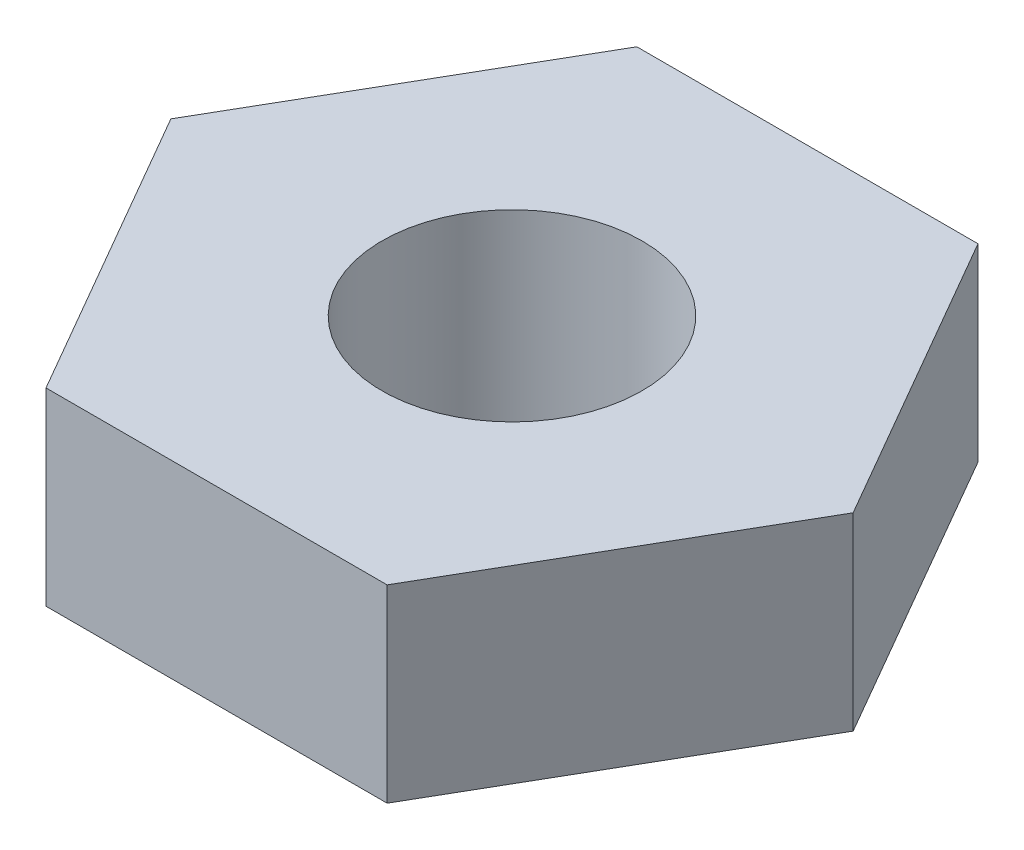
ISO-10303-21;
HEADER;
FILE_DESCRIPTION(('STEP AP214'),'2;1');
FILE_NAME('part.step','',(''),(''),'','','');
FILE_SCHEMA(('AUTOMOTIVE_DESIGN { 1 0 10303 214 1 1 1 1 }'));
ENDSEC;
DATA;
#1=APPLICATION_CONTEXT('core data for automotive mechanical design processes');
#2=APPLICATION_PROTOCOL_DEFINITION('international standard','automotive_design',2000,#1);
#3=PRODUCT_CONTEXT('',#1,'mechanical');
#4=PRODUCT('Part','Part','',(#3));
#5=PRODUCT_RELATED_PRODUCT_CATEGORY('part','',(#4));
#6=PRODUCT_DEFINITION_FORMATION('','',#4);
#7=PRODUCT_DEFINITION_CONTEXT('part definition',#1,'design');
#8=PRODUCT_DEFINITION('design','',#6,#7);
#9=PRODUCT_DEFINITION_SHAPE('','',#8);
#10=(LENGTH_UNIT() NAMED_UNIT(*) SI_UNIT(.MILLI.,.METRE.));
#11=(NAMED_UNIT(*) PLANE_ANGLE_UNIT() SI_UNIT($,.RADIAN.));
#12=(NAMED_UNIT(*) SI_UNIT($,.STERADIAN.) SOLID_ANGLE_UNIT());
#13=UNCERTAINTY_MEASURE_WITH_UNIT(LENGTH_MEASURE(1.E-05),#10,'distance_accuracy_value','');
#14=(GEOMETRIC_REPRESENTATION_CONTEXT(3) GLOBAL_UNCERTAINTY_ASSIGNED_CONTEXT((#13)) GLOBAL_UNIT_ASSIGNED_CONTEXT((#10,
#11,#12)) REPRESENTATION_CONTEXT('',''));
#15=CARTESIAN_POINT('',(0.,0.,0.));
#16=DIRECTION('',(0.,0.,1.));
#17=DIRECTION('',(1.,0.,0.));
#18=AXIS2_PLACEMENT_3D('',#15,#16,#17);
#19=CARTESIAN_POINT('',(0.721687933526279,0.799999999999999,-1.25000016807691));
#20=DIRECTION('',(0.,0.,0.999999999999997));
#21=DIRECTION('',(0.999999999999997,0.,0.));
#22=AXIS2_PLACEMENT_3D('',#19,#20,#21);
#23=PLANE('',#22);
#24=DIRECTION('',(-0.999999999999997,0.,0.));
#25=VECTOR('',#24,1.);
#26=CARTESIAN_POINT('',(0.721687933526279,0.,-1.25000016807691));
#27=LINE('',#26,#25);
#28=CARTESIAN_POINT('',(0.721687933526279,0.,-1.25000016807691));
#29=VERTEX_POINT('',#28);
#30=CARTESIAN_POINT('',(-0.721687933526278,0.,-1.25000016807691));
#31=VERTEX_POINT('',#30);
#32=EDGE_CURVE('E116',#29,#31,#27,.T.);
#33=ORIENTED_EDGE('',*,*,#32,.T.);
#34=DIRECTION('',(0.,-1.,0.));
#35=VECTOR('',#34,1.);
#36=CARTESIAN_POINT('',(-0.721687933526278,0.799999999999999,-1.25000016807691));
#37=LINE('',#36,#35);
#38=CARTESIAN_POINT('',(-0.721687933526278,0.799999999999999,-1.25000016807691));
#39=VERTEX_POINT('',#38);
#40=EDGE_CURVE('E11',#39,#31,#37,.T.);
#41=ORIENTED_EDGE('',*,*,#40,.F.);
#42=DIRECTION('',(-0.999999999999997,0.,0.));
#43=VECTOR('',#42,1.);
#44=CARTESIAN_POINT('',(0.721687933526279,0.799999999999999,-1.25000016807691));
#45=LINE('',#44,#43);
#46=CARTESIAN_POINT('',(0.721687933526279,0.799999999999999,-1.25000016807691));
#47=VERTEX_POINT('',#46);
#48=EDGE_CURVE('E127',#47,#39,#45,.T.);
#49=ORIENTED_EDGE('',*,*,#48,.F.);
#50=DIRECTION('',(0.,-1.,0.));
#51=VECTOR('',#50,1.);
#52=CARTESIAN_POINT('',(0.721687933526279,0.799999999999999,-1.25000016807691));
#53=LINE('',#52,#51);
#54=EDGE_CURVE('E112',#47,#29,#53,.T.);
#55=ORIENTED_EDGE('',*,*,#54,.T.);
#56=EDGE_LOOP('',(#33,#41,#49,#55));
#57=FACE_BOUND('',#56,.T.);
#58=ADVANCED_FACE('F32',(#57),#23,.F.);
#59=CARTESIAN_POINT('',(-0.721687933526278,0.799999999999999,-1.25000016807691));
#60=DIRECTION('',(0.866025403784436,0.,0.499999999999998));
#61=DIRECTION('',(0.499999999999998,0.,-0.866025403784436));
#62=AXIS2_PLACEMENT_3D('',#59,#60,#61);
#63=PLANE('',#62);
#64=DIRECTION('',(-0.499999999999998,0.,0.866025403784437));
#65=VECTOR('',#64,1.);
#66=CARTESIAN_POINT('',(-0.721687933526278,0.,-1.25000016807691));
#67=LINE('',#66,#65);
#68=CARTESIAN_POINT('',(-1.44337586705256,0.,0.));
#69=VERTEX_POINT('',#68);
#70=EDGE_CURVE('E119',#31,#69,#67,.T.);
#71=ORIENTED_EDGE('',*,*,#70,.T.);
#72=DIRECTION('',(0.,-1.,0.));
#73=VECTOR('',#72,1.);
#74=CARTESIAN_POINT('',(-1.44337586705256,0.799999999999999,0.));
#75=LINE('',#74,#73);
#76=CARTESIAN_POINT('',(-1.44337586705256,0.799999999999999,0.));
#77=VERTEX_POINT('',#76);
#78=EDGE_CURVE('E40',#77,#69,#75,.T.);
#79=ORIENTED_EDGE('',*,*,#78,.F.);
#80=DIRECTION('',(-0.499999999999998,0.,0.866025403784437));
#81=VECTOR('',#80,1.);
#82=CARTESIAN_POINT('',(-0.721687933526278,0.799999999999999,-1.25000016807691));
#83=LINE('',#82,#81);
#84=EDGE_CURVE('E85',#39,#77,#83,.T.);
#85=ORIENTED_EDGE('',*,*,#84,.F.);
#86=ORIENTED_EDGE('',*,*,#40,.T.);
#87=EDGE_LOOP('',(#71,#79,#85,#86));
#88=FACE_BOUND('',#87,.T.);
#89=ADVANCED_FACE('F152',(#88),#63,.F.);
#90=CARTESIAN_POINT('',(-1.44337586705256,0.799999999999999,0.));
#91=DIRECTION('',(0.866025403784436,0.,-0.499999999999998));
#92=DIRECTION('',(-0.499999999999999,0.,-0.866025403784436));
#93=AXIS2_PLACEMENT_3D('',#90,#91,#92);
#94=PLANE('',#93);
#95=DIRECTION('',(0.499999999999998,0.,0.866025403784436));
#96=VECTOR('',#95,1.);
#97=CARTESIAN_POINT('',(-1.44337586705256,0.,0.));
#98=LINE('',#97,#96);
#99=CARTESIAN_POINT('',(-0.721687933526277,0.,1.2500001680769));
#100=VERTEX_POINT('',#99);
#101=EDGE_CURVE('E122',#69,#100,#98,.T.);
#102=ORIENTED_EDGE('',*,*,#101,.T.);
#103=DIRECTION('',(0.,-1.,0.));
#104=VECTOR('',#103,1.);
#105=CARTESIAN_POINT('',(-0.721687933526277,0.8,1.2500001680769));
#106=LINE('',#105,#104);
#107=CARTESIAN_POINT('',(-0.721687933526277,0.8,1.2500001680769));
#108=VERTEX_POINT('',#107);
#109=EDGE_CURVE('E107',#108,#100,#106,.T.);
#110=ORIENTED_EDGE('',*,*,#109,.F.);
#111=DIRECTION('',(0.499999999999998,0.,0.866025403784436));
#112=VECTOR('',#111,1.);
#113=CARTESIAN_POINT('',(-1.44337586705256,0.799999999999999,0.));
#114=LINE('',#113,#112);
#115=EDGE_CURVE('E98',#77,#108,#114,.T.);
#116=ORIENTED_EDGE('',*,*,#115,.F.);
#117=ORIENTED_EDGE('',*,*,#78,.T.);
#118=EDGE_LOOP('',(#102,#110,#116,#117));
#119=FACE_BOUND('',#118,.T.);
#120=ADVANCED_FACE('F133',(#119),#94,.F.);
#121=CARTESIAN_POINT('',(-0.721687933526277,0.8,1.2500001680769));
#122=DIRECTION('',(0.,0.,-0.999999999999997));
#123=DIRECTION('',(-0.999999999999997,0.,0.));
#124=AXIS2_PLACEMENT_3D('',#121,#122,#123);
#125=PLANE('',#124);
#126=DIRECTION('',(0.999999999999997,0.,0.));
#127=VECTOR('',#126,1.);
#128=CARTESIAN_POINT('',(-0.721687933526277,0.,1.2500001680769));
#129=LINE('',#128,#127);
#130=CARTESIAN_POINT('',(0.721687933526278,0.,1.25000016807691));
#131=VERTEX_POINT('',#130);
#132=EDGE_CURVE('E106',#100,#131,#129,.T.);
#133=ORIENTED_EDGE('',*,*,#132,.T.);
#134=DIRECTION('',(0.,-1.,0.));
#135=VECTOR('',#134,1.);
#136=CARTESIAN_POINT('',(0.721687933526279,0.8,1.2500001680769));
#137=LINE('',#136,#135);
#138=CARTESIAN_POINT('',(0.721687933526279,0.8,1.2500001680769));
#139=VERTEX_POINT('',#138);
#140=EDGE_CURVE('E103',#139,#131,#137,.T.);
#141=ORIENTED_EDGE('',*,*,#140,.F.);
#142=DIRECTION('',(0.999999999999997,0.,0.));
#143=VECTOR('',#142,1.);
#144=CARTESIAN_POINT('',(-0.721687933526277,0.8,1.2500001680769));
#145=LINE('',#144,#143);
#146=EDGE_CURVE('E92',#108,#139,#145,.T.);
#147=ORIENTED_EDGE('',*,*,#146,.F.);
#148=ORIENTED_EDGE('',*,*,#109,.T.);
#149=EDGE_LOOP('',(#133,#141,#147,#148));
#150=FACE_BOUND('',#149,.T.);
#151=ADVANCED_FACE('F104',(#150),#125,.F.);
#152=CARTESIAN_POINT('',(0.721687933526279,0.8,1.2500001680769));
#153=DIRECTION('',(-0.866025403784437,0.,-0.499999999999998));
#154=DIRECTION('',(-0.499999999999998,0.,0.866025403784436));
#155=AXIS2_PLACEMENT_3D('',#152,#153,#154);
#156=PLANE('',#155);
#157=DIRECTION('',(0.499999999999998,0.,-0.866025403784437));
#158=VECTOR('',#157,1.);
#159=CARTESIAN_POINT('',(0.721687933526278,0.,1.25000016807691));
#160=LINE('',#159,#158);
#161=CARTESIAN_POINT('',(1.44337586705256,0.,0.));
#162=VERTEX_POINT('',#161);
#163=EDGE_CURVE('E71',#131,#162,#160,.T.);
#164=ORIENTED_EDGE('',*,*,#163,.T.);
#165=DIRECTION('',(0.,-1.,0.));
#166=VECTOR('',#165,1.);
#167=CARTESIAN_POINT('',(1.44337586705256,0.8,0.));
#168=LINE('',#167,#166);
#169=CARTESIAN_POINT('',(1.44337586705256,0.8,0.));
#170=VERTEX_POINT('',#169);
#171=EDGE_CURVE('E108',#170,#162,#168,.T.);
#172=ORIENTED_EDGE('',*,*,#171,.F.);
#173=DIRECTION('',(0.499999999999998,0.,-0.866025403784437));
#174=VECTOR('',#173,1.);
#175=CARTESIAN_POINT('',(0.721687933526279,0.8,1.2500001680769));
#176=LINE('',#175,#174);
#177=EDGE_CURVE('E96',#139,#170,#176,.T.);
#178=ORIENTED_EDGE('',*,*,#177,.F.);
#179=ORIENTED_EDGE('',*,*,#140,.T.);
#180=EDGE_LOOP('',(#164,#172,#178,#179));
#181=FACE_BOUND('',#180,.T.);
#182=ADVANCED_FACE('F110',(#181),#156,.F.);
#183=CARTESIAN_POINT('',(1.44337586705256,0.8,0.));
#184=DIRECTION('',(-0.866025403784436,0.,0.499999999999998));
#185=DIRECTION('',(0.499999999999998,0.,0.866025403784436));
#186=AXIS2_PLACEMENT_3D('',#183,#184,#185);
#187=PLANE('',#186);
#188=DIRECTION('',(-0.499999999999998,0.,-0.866025403784436));
#189=VECTOR('',#188,1.);
#190=CARTESIAN_POINT('',(1.44337586705256,0.,0.));
#191=LINE('',#190,#189);
#192=EDGE_CURVE('E77',#162,#29,#191,.T.);
#193=ORIENTED_EDGE('',*,*,#192,.T.);
#194=ORIENTED_EDGE('',*,*,#54,.F.);
#195=DIRECTION('',(-0.499999999999998,0.,-0.866025403784436));
#196=VECTOR('',#195,1.);
#197=CARTESIAN_POINT('',(1.44337586705256,0.8,0.));
#198=LINE('',#197,#196);
#199=EDGE_CURVE('E48',#170,#47,#198,.T.);
#200=ORIENTED_EDGE('',*,*,#199,.F.);
#201=ORIENTED_EDGE('',*,*,#171,.T.);
#202=EDGE_LOOP('',(#193,#194,#200,#201));
#203=FACE_BOUND('',#202,.T.);
#204=ADVANCED_FACE('F140',(#203),#187,.F.);
#205=CARTESIAN_POINT('',(0.,0.799999999999999,0.));
#206=DIRECTION('',(0.,1.,0.));
#207=DIRECTION('',(0.,0.,0.999999999999997));
#208=AXIS2_PLACEMENT_3D('',#205,#206,#207);
#209=PLANE('',#208);
#210=CARTESIAN_POINT('',(0.,0.799999999999999,0.));
#211=DIRECTION('',(0.,-1.,0.));
#212=DIRECTION('',(0.,0.,-0.999999999999997));
#213=AXIS2_PLACEMENT_3D('',#210,#211,#212);
#214=CIRCLE('',#213,0.55);
#215=CARTESIAN_POINT('',(0.,0.799999999999999,-0.549999999999998));
#216=VERTEX_POINT('',#215);
#217=EDGE_CURVE('E120',#216,#216,#214,.T.);
#218=ORIENTED_EDGE('',*,*,#217,.T.);
#219=EDGE_LOOP('',(#218));
#220=FACE_BOUND('',#219,.T.);
#221=ORIENTED_EDGE('',*,*,#48,.T.);
#222=ORIENTED_EDGE('',*,*,#84,.T.);
#223=ORIENTED_EDGE('',*,*,#115,.T.);
#224=ORIENTED_EDGE('',*,*,#146,.T.);
#225=ORIENTED_EDGE('',*,*,#177,.T.);
#226=ORIENTED_EDGE('',*,*,#199,.T.);
#227=EDGE_LOOP('',(#221,#222,#223,#224,#225,#226));
#228=FACE_BOUND('',#227,.T.);
#229=ADVANCED_FACE('F94',(#220,#228),#209,.T.);
#230=CARTESIAN_POINT('',(0.,0.,0.));
#231=DIRECTION('',(0.,1.,0.));
#232=DIRECTION('',(0.,0.,0.999999999999997));
#233=AXIS2_PLACEMENT_3D('',#230,#231,#232);
#234=PLANE('',#233);
#235=CARTESIAN_POINT('',(0.,0.,0.));
#236=DIRECTION('',(0.,-1.,0.));
#237=DIRECTION('',(0.,0.,-0.999999999999997));
#238=AXIS2_PLACEMENT_3D('',#235,#236,#237);
#239=CIRCLE('',#238,0.55);
#240=CARTESIAN_POINT('',(0.,0.,-0.549999999999998));
#241=VERTEX_POINT('',#240);
#242=EDGE_CURVE('E197',#241,#241,#239,.T.);
#243=ORIENTED_EDGE('',*,*,#242,.F.);
#244=EDGE_LOOP('',(#243));
#245=FACE_BOUND('',#244,.T.);
#246=ORIENTED_EDGE('',*,*,#32,.F.);
#247=ORIENTED_EDGE('',*,*,#192,.F.);
#248=ORIENTED_EDGE('',*,*,#163,.F.);
#249=ORIENTED_EDGE('',*,*,#132,.F.);
#250=ORIENTED_EDGE('',*,*,#101,.F.);
#251=ORIENTED_EDGE('',*,*,#70,.F.);
#252=EDGE_LOOP('',(#246,#247,#248,#249,#250,#251));
#253=FACE_BOUND('',#252,.T.);
#254=ADVANCED_FACE('F136',(#245,#253),#234,.F.);
#255=CARTESIAN_POINT('',(0.,0.799999999999999,0.));
#256=DIRECTION('',(0.,-1.,0.));
#257=DIRECTION('',(0.,0.,-0.999999999999997));
#258=AXIS2_PLACEMENT_3D('',#255,#256,#257);
#259=CYLINDRICAL_SURFACE('',#258,0.55);
#260=ORIENTED_EDGE('',*,*,#217,.F.);
#261=EDGE_LOOP('',(#260));
#262=FACE_BOUND('',#261,.T.);
#263=ORIENTED_EDGE('',*,*,#242,.T.);
#264=EDGE_LOOP('',(#263));
#265=FACE_BOUND('',#264,.T.);
#266=ADVANCED_FACE('F183',(#262,#265),#259,.F.);
#267=CLOSED_SHELL('',(#58,#89,#120,#151,#182,#204,#229,#254,#266));
#268=MANIFOLD_SOLID_BREP('B2',#267);
#269=ADVANCED_BREP_SHAPE_REPRESENTATION('',(#18,#268),#14);
#270=SHAPE_DEFINITION_REPRESENTATION(#9,#269);
ENDSEC;
END-ISO-10303-21;
